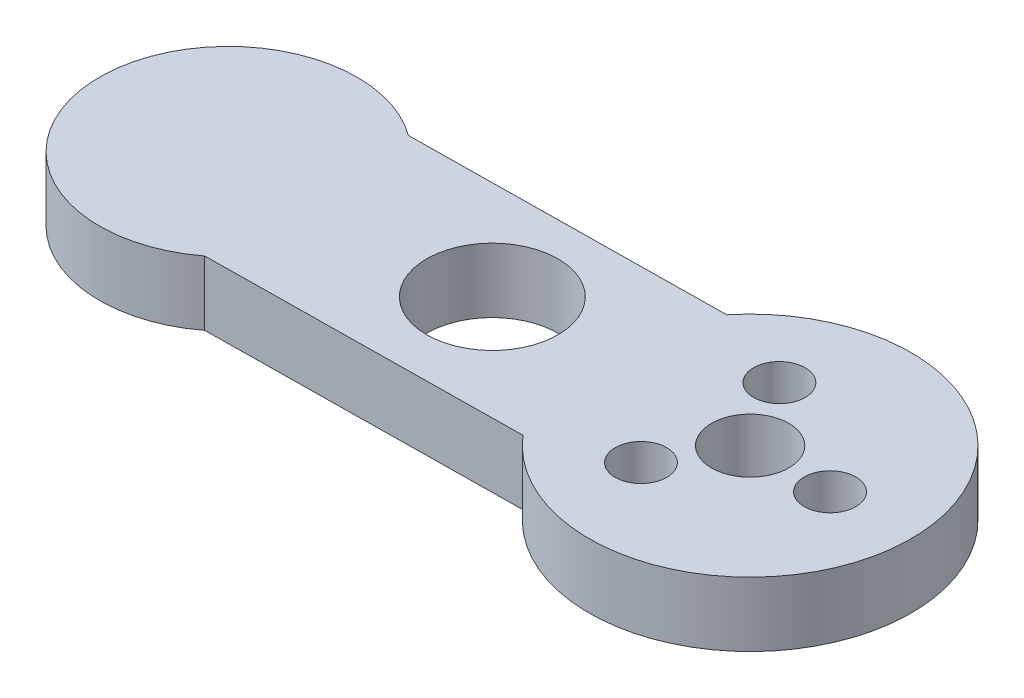
ISO-10303-21;
HEADER;
FILE_DESCRIPTION(('STEP AP214'),'2;1');
FILE_NAME('part.step','',(''),(''),'','','');
FILE_SCHEMA(('AUTOMOTIVE_DESIGN { 1 0 10303 214 1 1 1 1 }'));
ENDSEC;
DATA;
#1=APPLICATION_CONTEXT('core data for automotive mechanical design processes');
#2=APPLICATION_PROTOCOL_DEFINITION('international standard','automotive_design',2000,#1);
#3=PRODUCT_CONTEXT('',#1,'mechanical');
#4=PRODUCT('Part','Part','',(#3));
#5=PRODUCT_RELATED_PRODUCT_CATEGORY('part','',(#4));
#6=PRODUCT_DEFINITION_FORMATION('','',#4);
#7=PRODUCT_DEFINITION_CONTEXT('part definition',#1,'design');
#8=PRODUCT_DEFINITION('design','',#6,#7);
#9=PRODUCT_DEFINITION_SHAPE('','',#8);
#10=(LENGTH_UNIT() NAMED_UNIT(*) SI_UNIT(.MILLI.,.METRE.));
#11=(NAMED_UNIT(*) PLANE_ANGLE_UNIT() SI_UNIT($,.RADIAN.));
#12=(NAMED_UNIT(*) SI_UNIT($,.STERADIAN.) SOLID_ANGLE_UNIT());
#13=UNCERTAINTY_MEASURE_WITH_UNIT(LENGTH_MEASURE(1.E-05),#10,'distance_accuracy_value','');
#14=(GEOMETRIC_REPRESENTATION_CONTEXT(3) GLOBAL_UNCERTAINTY_ASSIGNED_CONTEXT((#13)) GLOBAL_UNIT_ASSIGNED_CONTEXT((#10,
#11,#12)) REPRESENTATION_CONTEXT('',''));
#15=CARTESIAN_POINT('',(0.,0.,0.));
#16=DIRECTION('',(0.,0.,1.));
#17=DIRECTION('',(1.,0.,0.));
#18=AXIS2_PLACEMENT_3D('',#15,#16,#17);
#19=CARTESIAN_POINT('',(-39.9970147864181,5.,0.488680033409613));
#20=DIRECTION('',(0.,-1.,0.));
#21=DIRECTION('',(0.,0.,-1.));
#22=AXIS2_PLACEMENT_3D('',#19,#20,#21);
#23=CYLINDRICAL_SURFACE('',#22,10.);
#24=CARTESIAN_POINT('',(-39.9970147864181,0.,0.488680033409613));
#25=DIRECTION('',(0.,1.,0.));
#26=DIRECTION('',(0.,0.,1.));
#27=AXIS2_PLACEMENT_3D('',#24,#25,#26);
#28=CIRCLE('',#27,10.);
#29=CARTESIAN_POINT('',(-34.0951985751373,0.,-7.58402492888544));
#30=VERTEX_POINT('',#29);
#31=CARTESIAN_POINT('',(-33.8997265617735,0.,8.41478098568179));
#32=VERTEX_POINT('',#31);
#33=EDGE_CURVE('E134',#30,#32,#28,.T.);
#34=ORIENTED_EDGE('',*,*,#33,.T.);
#35=DIRECTION('',(0.,-1.,0.));
#36=VECTOR('',#35,1.);
#37=CARTESIAN_POINT('',(-33.8997265617735,5.,8.41478098568179));
#38=LINE('',#37,#36);
#39=CARTESIAN_POINT('',(-33.8997265617735,5.,8.41478098568179));
#40=VERTEX_POINT('',#39);
#41=EDGE_CURVE('E11',#40,#32,#38,.T.);
#42=ORIENTED_EDGE('',*,*,#41,.F.);
#43=CARTESIAN_POINT('',(-39.9970147864181,5.,0.488680033409613));
#44=DIRECTION('',(0.,1.,0.));
#45=DIRECTION('',(0.,0.,1.));
#46=AXIS2_PLACEMENT_3D('',#43,#44,#45);
#47=CIRCLE('',#46,10.);
#48=CARTESIAN_POINT('',(-34.0951985751373,5.,-7.58402492888544));
#49=VERTEX_POINT('',#48);
#50=EDGE_CURVE('E86',#49,#40,#47,.T.);
#51=ORIENTED_EDGE('',*,*,#50,.F.);
#52=DIRECTION('',(0.,-1.,0.));
#53=VECTOR('',#52,1.);
#54=CARTESIAN_POINT('',(-34.0951985751373,5.,-7.58402492888544));
#55=LINE('',#54,#53);
#56=EDGE_CURVE('E133',#49,#30,#55,.T.);
#57=ORIENTED_EDGE('',*,*,#56,.T.);
#58=EDGE_LOOP('',(#34,#42,#51,#57));
#59=FACE_BOUND('',#58,.T.);
#60=ADVANCED_FACE('F43',(#59),#23,.T.);
#61=CARTESIAN_POINT('',(0.0977360066819224,5.,7.99940295728362));
#62=DIRECTION('',(0.0122170008352403,0.,0.999925369660452));
#63=DIRECTION('',(0.999925369660452,0.,-0.0122170008352403));
#64=AXIS2_PLACEMENT_3D('',#61,#62,#63);
#65=PLANE('',#64);
#66=DIRECTION('',(-0.999925369660452,0.,0.0122170008352403));
#67=VECTOR('',#66,1.);
#68=CARTESIAN_POINT('',(0.0977360066819224,0.,7.99940295728362));
#69=LINE('',#68,#67);
#70=CARTESIAN_POINT('',(-9.50623354846334,0.,8.11674341851891));
#71=VERTEX_POINT('',#70);
#72=EDGE_CURVE('E96',#71,#32,#69,.T.);
#73=ORIENTED_EDGE('',*,*,#72,.F.);
#74=DIRECTION('',(0.,-1.,0.));
#75=VECTOR('',#74,1.);
#76=CARTESIAN_POINT('',(-9.50623354846334,5.,8.11674341851891));
#77=LINE('',#76,#75);
#78=CARTESIAN_POINT('',(-9.50623354846334,5.,8.11674341851891));
#79=VERTEX_POINT('',#78);
#80=EDGE_CURVE('E52',#79,#71,#77,.T.);
#81=ORIENTED_EDGE('',*,*,#80,.F.);
#82=DIRECTION('',(-0.999925369660452,0.,0.0122170008352403));
#83=VECTOR('',#82,1.);
#84=CARTESIAN_POINT('',(0.0977360066819224,5.,7.99940295728362));
#85=LINE('',#84,#83);
#86=EDGE_CURVE('E94',#79,#40,#85,.T.);
#87=ORIENTED_EDGE('',*,*,#86,.T.);
#88=ORIENTED_EDGE('',*,*,#41,.T.);
#89=EDGE_LOOP('',(#73,#81,#87,#88));
#90=FACE_BOUND('',#89,.T.);
#91=ADVANCED_FACE('F93',(#90),#65,.T.);
#92=CARTESIAN_POINT('',(0.,5.,0.));
#93=DIRECTION('',(0.,-1.,0.));
#94=DIRECTION('',(0.,0.,-1.));
#95=AXIS2_PLACEMENT_3D('',#92,#93,#94);
#96=CYLINDRICAL_SURFACE('',#95,12.5);
#97=CARTESIAN_POINT('',(0.,0.,0.));
#98=DIRECTION('',(0.,1.,0.));
#99=DIRECTION('',(0.,0.,1.));
#100=AXIS2_PLACEMENT_3D('',#97,#98,#99);
#101=CIRCLE('',#100,12.5);
#102=CARTESIAN_POINT('',(-9.70170556182719,0.,-7.88206249604832));
#103=VERTEX_POINT('',#102);
#104=EDGE_CURVE('E75',#71,#103,#101,.T.);
#105=ORIENTED_EDGE('',*,*,#104,.T.);
#106=DIRECTION('',(0.,-1.,0.));
#107=VECTOR('',#106,1.);
#108=CARTESIAN_POINT('',(-9.70170556182719,5.,-7.88206249604832));
#109=LINE('',#108,#107);
#110=CARTESIAN_POINT('',(-9.70170556182719,5.,-7.88206249604832));
#111=VERTEX_POINT('',#110);
#112=EDGE_CURVE('E98',#111,#103,#109,.T.);
#113=ORIENTED_EDGE('',*,*,#112,.F.);
#114=CARTESIAN_POINT('',(0.,5.,0.));
#115=DIRECTION('',(0.,1.,0.));
#116=DIRECTION('',(0.,0.,1.));
#117=AXIS2_PLACEMENT_3D('',#114,#115,#116);
#118=CIRCLE('',#117,12.5);
#119=EDGE_CURVE('E99',#79,#111,#118,.T.);
#120=ORIENTED_EDGE('',*,*,#119,.F.);
#121=ORIENTED_EDGE('',*,*,#80,.T.);
#122=EDGE_LOOP('',(#105,#113,#120,#121));
#123=FACE_BOUND('',#122,.T.);
#124=ADVANCED_FACE('F100',(#123),#96,.T.);
#125=CARTESIAN_POINT('',(6.2,5.,0.));
#126=DIRECTION('',(0.,-1.,0.));
#127=DIRECTION('',(0.,0.,-1.));
#128=AXIS2_PLACEMENT_3D('',#125,#126,#127);
#129=CYLINDRICAL_SURFACE('',#128,2.);
#130=CARTESIAN_POINT('',(6.2,5.,0.));
#131=DIRECTION('',(0.,1.,0.));
#132=DIRECTION('',(0.,0.,1.));
#133=AXIS2_PLACEMENT_3D('',#130,#131,#132);
#134=CIRCLE('',#133,2.);
#135=CARTESIAN_POINT('',(6.2,5.,2.));
#136=VERTEX_POINT('',#135);
#137=EDGE_CURVE('E125',#136,#136,#134,.T.);
#138=ORIENTED_EDGE('',*,*,#137,.T.);
#139=EDGE_LOOP('',(#138));
#140=FACE_BOUND('',#139,.T.);
#141=CARTESIAN_POINT('',(6.2,0.,0.));
#142=DIRECTION('',(0.,1.,0.));
#143=DIRECTION('',(0.,0.,1.));
#144=AXIS2_PLACEMENT_3D('',#141,#142,#143);
#145=CIRCLE('',#144,2.);
#146=CARTESIAN_POINT('',(6.2,0.,2.));
#147=VERTEX_POINT('',#146);
#148=EDGE_CURVE('E156',#147,#147,#145,.T.);
#149=ORIENTED_EDGE('',*,*,#148,.F.);
#150=EDGE_LOOP('',(#149));
#151=FACE_BOUND('',#150,.T.);
#152=ADVANCED_FACE('F179',(#140,#151),#129,.F.);
#153=CARTESIAN_POINT('',(-3.1,5.,5.36935750346352));
#154=DIRECTION('',(0.,-1.,0.));
#155=DIRECTION('',(0.,0.,-1.));
#156=AXIS2_PLACEMENT_3D('',#153,#154,#155);
#157=CYLINDRICAL_SURFACE('',#156,2.);
#158=CARTESIAN_POINT('',(-3.1,5.,5.36935750346352));
#159=DIRECTION('',(0.,1.,0.));
#160=DIRECTION('',(0.,0.,1.));
#161=AXIS2_PLACEMENT_3D('',#158,#159,#160);
#162=CIRCLE('',#161,2.);
#163=CARTESIAN_POINT('',(-3.1,5.,7.36935750346352));
#164=VERTEX_POINT('',#163);
#165=EDGE_CURVE('E121',#164,#164,#162,.T.);
#166=ORIENTED_EDGE('',*,*,#165,.T.);
#167=EDGE_LOOP('',(#166));
#168=FACE_BOUND('',#167,.T.);
#169=CARTESIAN_POINT('',(-3.1,0.,5.36935750346352));
#170=DIRECTION('',(0.,1.,0.));
#171=DIRECTION('',(0.,0.,1.));
#172=AXIS2_PLACEMENT_3D('',#169,#170,#171);
#173=CIRCLE('',#172,2.);
#174=CARTESIAN_POINT('',(-3.1,0.,7.36935750346352));
#175=VERTEX_POINT('',#174);
#176=EDGE_CURVE('E152',#175,#175,#173,.T.);
#177=ORIENTED_EDGE('',*,*,#176,.F.);
#178=EDGE_LOOP('',(#177));
#179=FACE_BOUND('',#178,.T.);
#180=ADVANCED_FACE('F192',(#168,#179),#157,.F.);
#181=CARTESIAN_POINT('',(-3.1,5.,-5.36935750346352));
#182=DIRECTION('',(0.,-1.,0.));
#183=DIRECTION('',(0.,0.,-1.));
#184=AXIS2_PLACEMENT_3D('',#181,#182,#183);
#185=CYLINDRICAL_SURFACE('',#184,2.);
#186=CARTESIAN_POINT('',(-3.1,5.,-5.36935750346352));
#187=DIRECTION('',(0.,1.,0.));
#188=DIRECTION('',(0.,0.,1.));
#189=AXIS2_PLACEMENT_3D('',#186,#187,#188);
#190=CIRCLE('',#189,2.);
#191=CARTESIAN_POINT('',(-3.1,5.,-3.36935750346352));
#192=VERTEX_POINT('',#191);
#193=EDGE_CURVE('E117',#192,#192,#190,.T.);
#194=ORIENTED_EDGE('',*,*,#193,.T.);
#195=EDGE_LOOP('',(#194));
#196=FACE_BOUND('',#195,.T.);
#197=CARTESIAN_POINT('',(-3.1,0.,-5.36935750346352));
#198=DIRECTION('',(0.,1.,0.));
#199=DIRECTION('',(0.,0.,1.));
#200=AXIS2_PLACEMENT_3D('',#197,#198,#199);
#201=CIRCLE('',#200,2.);
#202=CARTESIAN_POINT('',(-3.1,0.,-3.36935750346352));
#203=VERTEX_POINT('',#202);
#204=EDGE_CURVE('E148',#203,#203,#201,.T.);
#205=ORIENTED_EDGE('',*,*,#204,.F.);
#206=EDGE_LOOP('',(#205));
#207=FACE_BOUND('',#206,.T.);
#208=ADVANCED_FACE('F188',(#196,#207),#185,.F.);
#209=CARTESIAN_POINT('',(-20.,5.,0.));
#210=DIRECTION('',(0.,-1.,0.));
#211=DIRECTION('',(0.,0.,-1.));
#212=AXIS2_PLACEMENT_3D('',#209,#210,#211);
#213=CYLINDRICAL_SURFACE('',#212,5.1);
#214=CARTESIAN_POINT('',(-20.,5.,0.));
#215=DIRECTION('',(0.,1.,0.));
#216=DIRECTION('',(0.,0.,1.));
#217=AXIS2_PLACEMENT_3D('',#214,#215,#216);
#218=CIRCLE('',#217,5.1);
#219=CARTESIAN_POINT('',(-20.,5.,5.1));
#220=VERTEX_POINT('',#219);
#221=EDGE_CURVE('E113',#220,#220,#218,.T.);
#222=ORIENTED_EDGE('',*,*,#221,.T.);
#223=EDGE_LOOP('',(#222));
#224=FACE_BOUND('',#223,.T.);
#225=CARTESIAN_POINT('',(-20.,0.,0.));
#226=DIRECTION('',(0.,1.,0.));
#227=DIRECTION('',(0.,0.,1.));
#228=AXIS2_PLACEMENT_3D('',#225,#226,#227);
#229=CIRCLE('',#228,5.1);
#230=CARTESIAN_POINT('',(-20.,0.,5.1));
#231=VERTEX_POINT('',#230);
#232=EDGE_CURVE('E144',#231,#231,#229,.T.);
#233=ORIENTED_EDGE('',*,*,#232,.F.);
#234=EDGE_LOOP('',(#233));
#235=FACE_BOUND('',#234,.T.);
#236=ADVANCED_FACE('F185',(#224,#235),#213,.F.);
#237=CARTESIAN_POINT('',(-0.0977360066819235,5.,-7.99940295728362));
#238=DIRECTION('',(0.0122170008352404,0.,0.999925369660452));
#239=DIRECTION('',(0.999925369660452,0.,-0.0122170008352404));
#240=AXIS2_PLACEMENT_3D('',#237,#238,#239);
#241=PLANE('',#240);
#242=DIRECTION('',(-0.999925369660452,0.,0.0122170008352404));
#243=VECTOR('',#242,1.);
#244=CARTESIAN_POINT('',(-0.0977360066819235,0.,-7.99940295728362));
#245=LINE('',#244,#243);
#246=EDGE_CURVE('E81',#103,#30,#245,.T.);
#247=ORIENTED_EDGE('',*,*,#246,.T.);
#248=ORIENTED_EDGE('',*,*,#56,.F.);
#249=DIRECTION('',(-0.999925369660452,0.,0.0122170008352404));
#250=VECTOR('',#249,1.);
#251=CARTESIAN_POINT('',(-0.0977360066819235,5.,-7.99940295728362));
#252=LINE('',#251,#250);
#253=EDGE_CURVE('E60',#111,#49,#252,.T.);
#254=ORIENTED_EDGE('',*,*,#253,.F.);
#255=ORIENTED_EDGE('',*,*,#112,.T.);
#256=EDGE_LOOP('',(#247,#248,#254,#255));
#257=FACE_BOUND('',#256,.T.);
#258=ADVANCED_FACE('F166',(#257),#241,.F.);
#259=CARTESIAN_POINT('',(0.,5.,0.));
#260=DIRECTION('',(0.,-1.,0.));
#261=DIRECTION('',(0.,0.,-1.));
#262=AXIS2_PLACEMENT_3D('',#259,#260,#261);
#263=CYLINDRICAL_SURFACE('',#262,3.);
#264=CARTESIAN_POINT('',(0.,5.,0.));
#265=DIRECTION('',(0.,1.,0.));
#266=DIRECTION('',(0.,0.,1.));
#267=AXIS2_PLACEMENT_3D('',#264,#265,#266);
#268=CIRCLE('',#267,3.);
#269=CARTESIAN_POINT('',(0.,5.,3.));
#270=VERTEX_POINT('',#269);
#271=EDGE_CURVE('E129',#270,#270,#268,.T.);
#272=ORIENTED_EDGE('',*,*,#271,.T.);
#273=EDGE_LOOP('',(#272));
#274=FACE_BOUND('',#273,.T.);
#275=CARTESIAN_POINT('',(0.,0.,0.));
#276=DIRECTION('',(0.,1.,0.));
#277=DIRECTION('',(0.,0.,1.));
#278=AXIS2_PLACEMENT_3D('',#275,#276,#277);
#279=CIRCLE('',#278,3.);
#280=CARTESIAN_POINT('',(0.,0.,3.));
#281=VERTEX_POINT('',#280);
#282=EDGE_CURVE('E108',#281,#281,#279,.T.);
#283=ORIENTED_EDGE('',*,*,#282,.F.);
#284=EDGE_LOOP('',(#283));
#285=FACE_BOUND('',#284,.T.);
#286=ADVANCED_FACE('F184',(#274,#285),#263,.F.);
#287=CARTESIAN_POINT('',(0.,5.,0.));
#288=DIRECTION('',(0.,1.,0.));
#289=DIRECTION('',(0.,0.,1.));
#290=AXIS2_PLACEMENT_3D('',#287,#288,#289);
#291=PLANE('',#290);
#292=ORIENTED_EDGE('',*,*,#50,.T.);
#293=ORIENTED_EDGE('',*,*,#86,.F.);
#294=ORIENTED_EDGE('',*,*,#119,.T.);
#295=ORIENTED_EDGE('',*,*,#253,.T.);
#296=EDGE_LOOP('',(#292,#293,#294,#295));
#297=FACE_BOUND('',#296,.T.);
#298=ORIENTED_EDGE('',*,*,#221,.F.);
#299=EDGE_LOOP('',(#298));
#300=FACE_BOUND('',#299,.T.);
#301=ORIENTED_EDGE('',*,*,#193,.F.);
#302=EDGE_LOOP('',(#301));
#303=FACE_BOUND('',#302,.T.);
#304=ORIENTED_EDGE('',*,*,#165,.F.);
#305=EDGE_LOOP('',(#304));
#306=FACE_BOUND('',#305,.T.);
#307=ORIENTED_EDGE('',*,*,#137,.F.);
#308=EDGE_LOOP('',(#307));
#309=FACE_BOUND('',#308,.T.);
#310=ORIENTED_EDGE('',*,*,#271,.F.);
#311=EDGE_LOOP('',(#310));
#312=FACE_BOUND('',#311,.T.);
#313=ADVANCED_FACE('F103',(#297,#300,#303,#306,#309,#312),#291,.T.);
#314=CARTESIAN_POINT('',(0.,0.,0.));
#315=DIRECTION('',(0.,1.,0.));
#316=DIRECTION('',(0.,0.,1.));
#317=AXIS2_PLACEMENT_3D('',#314,#315,#316);
#318=PLANE('',#317);
#319=ORIENTED_EDGE('',*,*,#33,.F.);
#320=ORIENTED_EDGE('',*,*,#246,.F.);
#321=ORIENTED_EDGE('',*,*,#104,.F.);
#322=ORIENTED_EDGE('',*,*,#72,.T.);
#323=EDGE_LOOP('',(#319,#320,#321,#322));
#324=FACE_BOUND('',#323,.T.);
#325=ORIENTED_EDGE('',*,*,#232,.T.);
#326=EDGE_LOOP('',(#325));
#327=FACE_BOUND('',#326,.T.);
#328=ORIENTED_EDGE('',*,*,#204,.T.);
#329=EDGE_LOOP('',(#328));
#330=FACE_BOUND('',#329,.T.);
#331=ORIENTED_EDGE('',*,*,#176,.T.);
#332=EDGE_LOOP('',(#331));
#333=FACE_BOUND('',#332,.T.);
#334=ORIENTED_EDGE('',*,*,#148,.T.);
#335=EDGE_LOOP('',(#334));
#336=FACE_BOUND('',#335,.T.);
#337=ORIENTED_EDGE('',*,*,#282,.T.);
#338=EDGE_LOOP('',(#337));
#339=FACE_BOUND('',#338,.T.);
#340=ADVANCED_FACE('F169',(#324,#327,#330,#333,#336,#339),#318,.F.);
#341=CLOSED_SHELL('',(#60,#91,#124,#152,#180,#208,#236,#258,#286,#313,#340));
#342=MANIFOLD_SOLID_BREP('B2',#341);
#343=ADVANCED_BREP_SHAPE_REPRESENTATION('',(#18,#342),#14);
#344=SHAPE_DEFINITION_REPRESENTATION(#9,#343);
ENDSEC;
END-ISO-10303-21;
